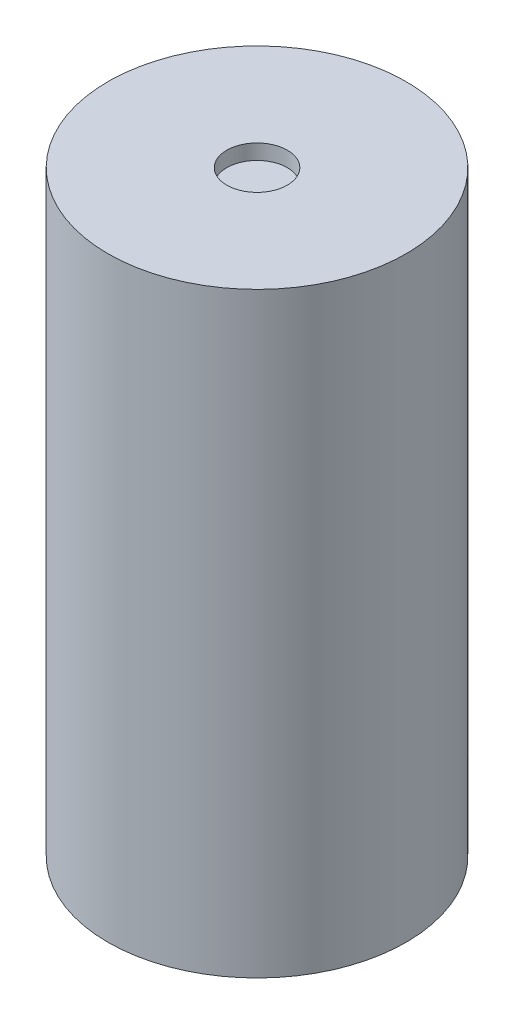
ISO-10303-21;
HEADER;
FILE_DESCRIPTION(('STEP AP214'),'2;1');
FILE_NAME('part.step','',(''),(''),'','','');
FILE_SCHEMA(('AUTOMOTIVE_DESIGN { 1 0 10303 214 1 1 1 1 }'));
ENDSEC;
DATA;
#1=APPLICATION_CONTEXT('core data for automotive mechanical design processes');
#2=APPLICATION_PROTOCOL_DEFINITION('international standard','automotive_design',2000,#1);
#3=PRODUCT_CONTEXT('',#1,'mechanical');
#4=PRODUCT('Part','Part','',(#3));
#5=PRODUCT_RELATED_PRODUCT_CATEGORY('part','',(#4));
#6=PRODUCT_DEFINITION_FORMATION('','',#4);
#7=PRODUCT_DEFINITION_CONTEXT('part definition',#1,'design');
#8=PRODUCT_DEFINITION('design','',#6,#7);
#9=PRODUCT_DEFINITION_SHAPE('','',#8);
#10=(LENGTH_UNIT() NAMED_UNIT(*) SI_UNIT(.MILLI.,.METRE.));
#11=(NAMED_UNIT(*) PLANE_ANGLE_UNIT() SI_UNIT($,.RADIAN.));
#12=(NAMED_UNIT(*) SI_UNIT($,.STERADIAN.) SOLID_ANGLE_UNIT());
#13=UNCERTAINTY_MEASURE_WITH_UNIT(LENGTH_MEASURE(1.E-05),#10,'distance_accuracy_value','');
#14=(GEOMETRIC_REPRESENTATION_CONTEXT(3) GLOBAL_UNCERTAINTY_ASSIGNED_CONTEXT((#13)) GLOBAL_UNIT_ASSIGNED_CONTEXT((#10,
#11,#12)) REPRESENTATION_CONTEXT('',''));
#15=CARTESIAN_POINT('',(0.,0.,0.));
#16=DIRECTION('',(0.,0.,1.));
#17=DIRECTION('',(1.,0.,0.));
#18=AXIS2_PLACEMENT_3D('',#15,#16,#17);
#19=CARTESIAN_POINT('',(0.,1000.,0.));
#20=DIRECTION('',(0.,-1.,0.));
#21=DIRECTION('',(0.,0.,-1.));
#22=AXIS2_PLACEMENT_3D('',#19,#20,#21);
#23=CYLINDRICAL_SURFACE('',#22,250.);
#24=CARTESIAN_POINT('',(0.,1000.,0.));
#25=DIRECTION('',(0.,1.,0.));
#26=DIRECTION('',(0.,0.,1.));
#27=AXIS2_PLACEMENT_3D('',#24,#25,#26);
#28=CIRCLE('',#27,250.);
#29=CARTESIAN_POINT('',(0.,1000.,250.));
#30=VERTEX_POINT('',#29);
#31=EDGE_CURVE('E10',#30,#30,#28,.T.);
#32=ORIENTED_EDGE('',*,*,#31,.F.);
#33=EDGE_LOOP('',(#32));
#34=FACE_BOUND('',#33,.T.);
#35=CARTESIAN_POINT('',(0.,0.,0.));
#36=DIRECTION('',(0.,1.,0.));
#37=DIRECTION('',(0.,0.,1.));
#38=AXIS2_PLACEMENT_3D('',#35,#36,#37);
#39=CIRCLE('',#38,250.);
#40=CARTESIAN_POINT('',(0.,0.,250.));
#41=VERTEX_POINT('',#40);
#42=EDGE_CURVE('E40',#41,#41,#39,.T.);
#43=ORIENTED_EDGE('',*,*,#42,.T.);
#44=EDGE_LOOP('',(#43));
#45=FACE_BOUND('',#44,.T.);
#46=ADVANCED_FACE('F37',(#34,#45),#23,.T.);
#47=CARTESIAN_POINT('',(0.,1000.,0.));
#48=DIRECTION('',(0.,1.,0.));
#49=DIRECTION('',(0.,0.,1.));
#50=AXIS2_PLACEMENT_3D('',#47,#48,#49);
#51=PLANE('',#50);
#52=CARTESIAN_POINT('',(0.,1000.,0.));
#53=DIRECTION('',(0.,1.,0.));
#54=DIRECTION('',(0.,0.,1.));
#55=AXIS2_PLACEMENT_3D('',#52,#53,#54);
#56=CIRCLE('',#55,50.8);
#57=CARTESIAN_POINT('',(0.,1000.,50.8));
#58=VERTEX_POINT('',#57);
#59=EDGE_CURVE('E49',#58,#58,#56,.T.);
#60=ORIENTED_EDGE('',*,*,#59,.F.);
#61=EDGE_LOOP('',(#60));
#62=FACE_BOUND('',#61,.T.);
#63=ORIENTED_EDGE('',*,*,#31,.T.);
#64=EDGE_LOOP('',(#63));
#65=FACE_BOUND('',#64,.T.);
#66=ADVANCED_FACE('F64',(#62,#65),#51,.T.);
#67=CARTESIAN_POINT('',(0.,0.,0.));
#68=DIRECTION('',(0.,1.,0.));
#69=DIRECTION('',(0.,0.,1.));
#70=AXIS2_PLACEMENT_3D('',#67,#68,#69);
#71=PLANE('',#70);
#72=ORIENTED_EDGE('',*,*,#42,.F.);
#73=EDGE_LOOP('',(#72));
#74=FACE_BOUND('',#73,.T.);
#75=ADVANCED_FACE('F60',(#74),#71,.F.);
#76=CARTESIAN_POINT('',(0.,974.6,0.));
#77=DIRECTION('',(0.,1.,0.));
#78=DIRECTION('',(0.,0.,1.));
#79=AXIS2_PLACEMENT_3D('',#76,#77,#78);
#80=CYLINDRICAL_SURFACE('',#79,50.8);
#81=CARTESIAN_POINT('',(0.,974.6,0.));
#82=DIRECTION('',(0.,1.,0.));
#83=DIRECTION('',(0.,0.,1.));
#84=AXIS2_PLACEMENT_3D('',#81,#82,#83);
#85=CIRCLE('',#84,50.8);
#86=CARTESIAN_POINT('',(0.,974.6,50.8));
#87=VERTEX_POINT('',#86);
#88=EDGE_CURVE('E47',#87,#87,#85,.T.);
#89=ORIENTED_EDGE('',*,*,#88,.F.);
#90=EDGE_LOOP('',(#89));
#91=FACE_BOUND('',#90,.T.);
#92=ORIENTED_EDGE('',*,*,#59,.T.);
#93=EDGE_LOOP('',(#92));
#94=FACE_BOUND('',#93,.T.);
#95=ADVANCED_FACE('F57',(#91,#94),#80,.F.);
#96=CARTESIAN_POINT('',(0.,974.6,0.));
#97=DIRECTION('',(0.,1.,0.));
#98=DIRECTION('',(0.,0.,1.));
#99=AXIS2_PLACEMENT_3D('',#96,#97,#98);
#100=PLANE('',#99);
#101=ORIENTED_EDGE('',*,*,#88,.T.);
#102=EDGE_LOOP('',(#101));
#103=FACE_BOUND('',#102,.T.);
#104=ADVANCED_FACE('F55',(#103),#100,.T.);
#105=CLOSED_SHELL('',(#46,#66,#75,#95,#104));
#106=MANIFOLD_SOLID_BREP('B2',#105);
#107=ADVANCED_BREP_SHAPE_REPRESENTATION('',(#18,#106),#14);
#108=SHAPE_DEFINITION_REPRESENTATION(#9,#107);
ENDSEC;
END-ISO-10303-21;
